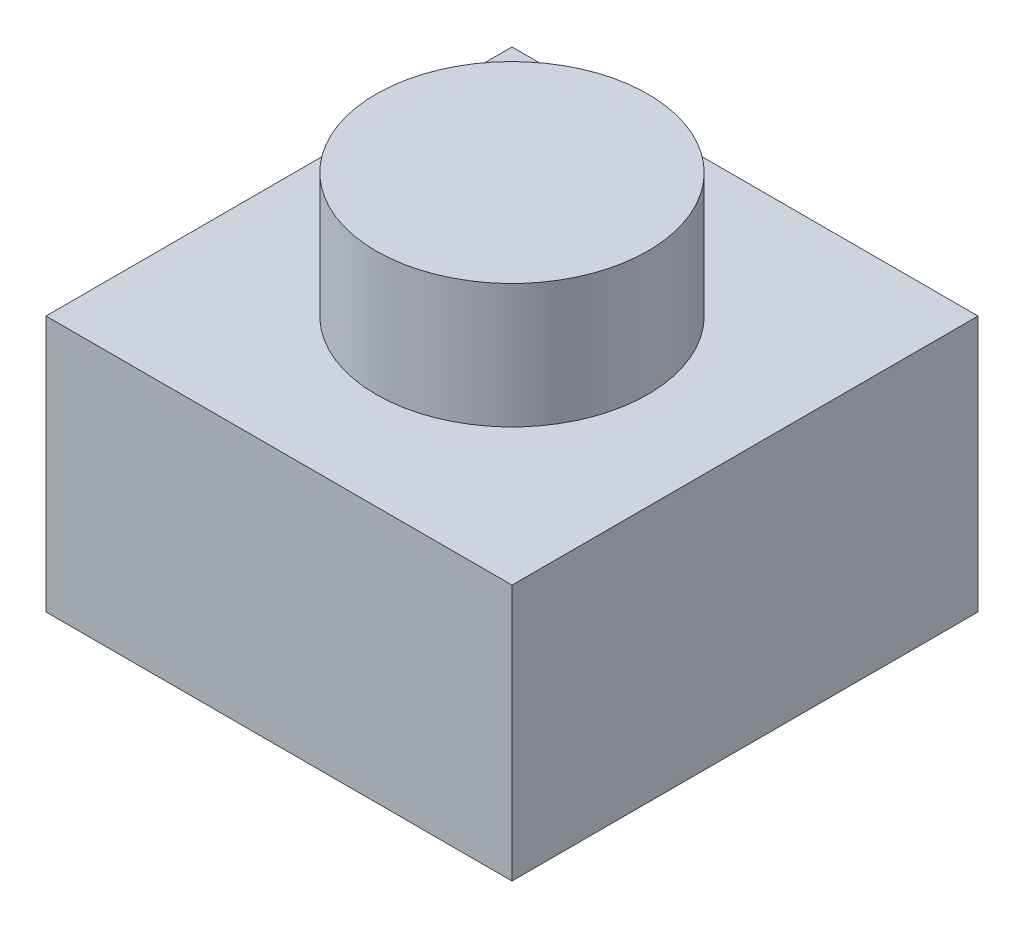
ISO-10303-21;
HEADER;
FILE_DESCRIPTION(('STEP AP214'),'2;1');
FILE_NAME('part.step','',(''),(''),'','','');
FILE_SCHEMA(('AUTOMOTIVE_DESIGN { 1 0 10303 214 1 1 1 1 }'));
ENDSEC;
DATA;
#1=APPLICATION_CONTEXT('core data for automotive mechanical design processes');
#2=APPLICATION_PROTOCOL_DEFINITION('international standard','automotive_design',2000,#1);
#3=PRODUCT_CONTEXT('',#1,'mechanical');
#4=PRODUCT('Part','Part','',(#3));
#5=PRODUCT_RELATED_PRODUCT_CATEGORY('part','',(#4));
#6=PRODUCT_DEFINITION_FORMATION('','',#4);
#7=PRODUCT_DEFINITION_CONTEXT('part definition',#1,'design');
#8=PRODUCT_DEFINITION('design','',#6,#7);
#9=PRODUCT_DEFINITION_SHAPE('','',#8);
#10=(LENGTH_UNIT() NAMED_UNIT(*) SI_UNIT(.MILLI.,.METRE.));
#11=(NAMED_UNIT(*) PLANE_ANGLE_UNIT() SI_UNIT($,.RADIAN.));
#12=(NAMED_UNIT(*) SI_UNIT($,.STERADIAN.) SOLID_ANGLE_UNIT());
#13=UNCERTAINTY_MEASURE_WITH_UNIT(LENGTH_MEASURE(1.E-05),#10,'distance_accuracy_value','');
#14=(GEOMETRIC_REPRESENTATION_CONTEXT(3) GLOBAL_UNCERTAINTY_ASSIGNED_CONTEXT((#13)) GLOBAL_UNIT_ASSIGNED_CONTEXT((#10,
#11,#12)) REPRESENTATION_CONTEXT('',''));
#15=CARTESIAN_POINT('',(0.,0.,0.));
#16=DIRECTION('',(0.,0.,1.));
#17=DIRECTION('',(1.,0.,0.));
#18=AXIS2_PLACEMENT_3D('',#15,#16,#17);
#19=CARTESIAN_POINT('',(-3.,3.3,3.));
#20=DIRECTION('',(1.,0.,0.));
#21=DIRECTION('',(0.,0.,-1.));
#22=AXIS2_PLACEMENT_3D('',#19,#20,#21);
#23=PLANE('',#22);
#24=DIRECTION('',(0.,0.,1.));
#25=VECTOR('',#24,1.);
#26=CARTESIAN_POINT('',(-3.,0.,3.));
#27=LINE('',#26,#25);
#28=CARTESIAN_POINT('',(-3.,0.,-3.));
#29=VERTEX_POINT('',#28);
#30=CARTESIAN_POINT('',(-3.,0.,3.));
#31=VERTEX_POINT('',#30);
#32=EDGE_CURVE('E98',#29,#31,#27,.T.);
#33=ORIENTED_EDGE('',*,*,#32,.T.);
#34=DIRECTION('',(0.,-1.,0.));
#35=VECTOR('',#34,1.);
#36=CARTESIAN_POINT('',(-3.,3.3,3.));
#37=LINE('',#36,#35);
#38=CARTESIAN_POINT('',(-3.,3.3,3.));
#39=VERTEX_POINT('',#38);
#40=EDGE_CURVE('E11',#39,#31,#37,.T.);
#41=ORIENTED_EDGE('',*,*,#40,.F.);
#42=DIRECTION('',(0.,0.,1.));
#43=VECTOR('',#42,1.);
#44=CARTESIAN_POINT('',(-3.,3.3,3.));
#45=LINE('',#44,#43);
#46=CARTESIAN_POINT('',(-3.,3.3,-3.));
#47=VERTEX_POINT('',#46);
#48=EDGE_CURVE('E86',#47,#39,#45,.T.);
#49=ORIENTED_EDGE('',*,*,#48,.F.);
#50=DIRECTION('',(0.,-1.,0.));
#51=VECTOR('',#50,1.);
#52=CARTESIAN_POINT('',(-3.,3.3,-3.));
#53=LINE('',#52,#51);
#54=EDGE_CURVE('E94',#47,#29,#53,.T.);
#55=ORIENTED_EDGE('',*,*,#54,.T.);
#56=EDGE_LOOP('',(#33,#41,#49,#55));
#57=FACE_BOUND('',#56,.T.);
#58=ADVANCED_FACE('F35',(#57),#23,.F.);
#59=CARTESIAN_POINT('',(3.,3.3,3.));
#60=DIRECTION('',(0.,0.,-1.));
#61=DIRECTION('',(-1.,0.,0.));
#62=AXIS2_PLACEMENT_3D('',#59,#60,#61);
#63=PLANE('',#62);
#64=DIRECTION('',(1.,0.,0.));
#65=VECTOR('',#64,1.);
#66=CARTESIAN_POINT('',(3.,0.,3.));
#67=LINE('',#66,#65);
#68=CARTESIAN_POINT('',(3.,0.,3.));
#69=VERTEX_POINT('',#68);
#70=EDGE_CURVE('E90',#31,#69,#67,.T.);
#71=ORIENTED_EDGE('',*,*,#70,.T.);
#72=DIRECTION('',(0.,-1.,0.));
#73=VECTOR('',#72,1.);
#74=CARTESIAN_POINT('',(3.,3.3,3.));
#75=LINE('',#74,#73);
#76=CARTESIAN_POINT('',(3.,3.3,3.));
#77=VERTEX_POINT('',#76);
#78=EDGE_CURVE('E43',#77,#69,#75,.T.);
#79=ORIENTED_EDGE('',*,*,#78,.F.);
#80=DIRECTION('',(1.,0.,0.));
#81=VECTOR('',#80,1.);
#82=CARTESIAN_POINT('',(3.,3.3,3.));
#83=LINE('',#82,#81);
#84=EDGE_CURVE('E81',#39,#77,#83,.T.);
#85=ORIENTED_EDGE('',*,*,#84,.F.);
#86=ORIENTED_EDGE('',*,*,#40,.T.);
#87=EDGE_LOOP('',(#71,#79,#85,#86));
#88=FACE_BOUND('',#87,.T.);
#89=ADVANCED_FACE('F89',(#88),#63,.F.);
#90=CARTESIAN_POINT('',(3.,3.3,3.));
#91=DIRECTION('',(-1.,0.,0.));
#92=DIRECTION('',(0.,0.,1.));
#93=AXIS2_PLACEMENT_3D('',#90,#91,#92);
#94=PLANE('',#93);
#95=DIRECTION('',(0.,0.,-1.));
#96=VECTOR('',#95,1.);
#97=CARTESIAN_POINT('',(3.,0.,3.));
#98=LINE('',#97,#96);
#99=CARTESIAN_POINT('',(3.,0.,-3.));
#100=VERTEX_POINT('',#99);
#101=EDGE_CURVE('E68',#69,#100,#98,.T.);
#102=ORIENTED_EDGE('',*,*,#101,.T.);
#103=DIRECTION('',(0.,-1.,0.));
#104=VECTOR('',#103,1.);
#105=CARTESIAN_POINT('',(3.,3.3,-3.));
#106=LINE('',#105,#104);
#107=CARTESIAN_POINT('',(3.,3.3,-3.));
#108=VERTEX_POINT('',#107);
#109=EDGE_CURVE('E91',#108,#100,#106,.T.);
#110=ORIENTED_EDGE('',*,*,#109,.F.);
#111=DIRECTION('',(0.,0.,-1.));
#112=VECTOR('',#111,1.);
#113=CARTESIAN_POINT('',(3.,3.3,3.));
#114=LINE('',#113,#112);
#115=EDGE_CURVE('E84',#77,#108,#114,.T.);
#116=ORIENTED_EDGE('',*,*,#115,.F.);
#117=ORIENTED_EDGE('',*,*,#78,.T.);
#118=EDGE_LOOP('',(#102,#110,#116,#117));
#119=FACE_BOUND('',#118,.T.);
#120=ADVANCED_FACE('F92',(#119),#94,.F.);
#121=CARTESIAN_POINT('',(3.,3.3,-3.));
#122=DIRECTION('',(0.,0.,1.));
#123=DIRECTION('',(1.,0.,0.));
#124=AXIS2_PLACEMENT_3D('',#121,#122,#123);
#125=PLANE('',#124);
#126=DIRECTION('',(-1.,0.,0.));
#127=VECTOR('',#126,1.);
#128=CARTESIAN_POINT('',(3.,0.,-3.));
#129=LINE('',#128,#127);
#130=EDGE_CURVE('E74',#100,#29,#129,.T.);
#131=ORIENTED_EDGE('',*,*,#130,.T.);
#132=ORIENTED_EDGE('',*,*,#54,.F.);
#133=DIRECTION('',(-1.,0.,0.));
#134=VECTOR('',#133,1.);
#135=CARTESIAN_POINT('',(3.,3.3,-3.));
#136=LINE('',#135,#134);
#137=EDGE_CURVE('E51',#108,#47,#136,.T.);
#138=ORIENTED_EDGE('',*,*,#137,.F.);
#139=ORIENTED_EDGE('',*,*,#109,.T.);
#140=EDGE_LOOP('',(#131,#132,#138,#139));
#141=FACE_BOUND('',#140,.T.);
#142=ADVANCED_FACE('F106',(#141),#125,.F.);
#143=CARTESIAN_POINT('',(0.,3.3,0.));
#144=DIRECTION('',(0.,1.,0.));
#145=DIRECTION('',(0.,0.,1.));
#146=AXIS2_PLACEMENT_3D('',#143,#144,#145);
#147=PLANE('',#146);
#148=CARTESIAN_POINT('',(0.,3.3,0.));
#149=DIRECTION('',(0.,1.,0.));
#150=DIRECTION('',(0.,0.,1.));
#151=AXIS2_PLACEMENT_3D('',#148,#149,#150);
#152=CIRCLE('',#151,1.75);
#153=CARTESIAN_POINT('',(0.,3.3,1.75));
#154=VERTEX_POINT('',#153);
#155=EDGE_CURVE('E112',#154,#154,#152,.T.);
#156=ORIENTED_EDGE('',*,*,#155,.F.);
#157=EDGE_LOOP('',(#156));
#158=FACE_BOUND('',#157,.T.);
#159=ORIENTED_EDGE('',*,*,#48,.T.);
#160=ORIENTED_EDGE('',*,*,#84,.T.);
#161=ORIENTED_EDGE('',*,*,#115,.T.);
#162=ORIENTED_EDGE('',*,*,#137,.T.);
#163=EDGE_LOOP('',(#159,#160,#161,#162));
#164=FACE_BOUND('',#163,.T.);
#165=ADVANCED_FACE('F82',(#158,#164),#147,.T.);
#166=CARTESIAN_POINT('',(0.,0.,0.));
#167=DIRECTION('',(0.,1.,0.));
#168=DIRECTION('',(0.,0.,1.));
#169=AXIS2_PLACEMENT_3D('',#166,#167,#168);
#170=PLANE('',#169);
#171=ORIENTED_EDGE('',*,*,#32,.F.);
#172=ORIENTED_EDGE('',*,*,#130,.F.);
#173=ORIENTED_EDGE('',*,*,#101,.F.);
#174=ORIENTED_EDGE('',*,*,#70,.F.);
#175=EDGE_LOOP('',(#171,#172,#173,#174));
#176=FACE_BOUND('',#175,.T.);
#177=ADVANCED_FACE('F109',(#176),#170,.F.);
#178=CARTESIAN_POINT('',(0.,4.9,0.));
#179=DIRECTION('',(0.,-1.,0.));
#180=DIRECTION('',(0.,0.,-1.));
#181=AXIS2_PLACEMENT_3D('',#178,#179,#180);
#182=CYLINDRICAL_SURFACE('',#181,1.75);
#183=CARTESIAN_POINT('',(0.,4.9,0.));
#184=DIRECTION('',(0.,1.,0.));
#185=DIRECTION('',(0.,0.,1.));
#186=AXIS2_PLACEMENT_3D('',#183,#184,#185);
#187=CIRCLE('',#186,1.75);
#188=CARTESIAN_POINT('',(0.,4.9,1.75));
#189=VERTEX_POINT('',#188);
#190=EDGE_CURVE('E101',#189,#189,#187,.T.);
#191=ORIENTED_EDGE('',*,*,#190,.F.);
#192=EDGE_LOOP('',(#191));
#193=FACE_BOUND('',#192,.T.);
#194=ORIENTED_EDGE('',*,*,#155,.T.);
#195=EDGE_LOOP('',(#194));
#196=FACE_BOUND('',#195,.T.);
#197=ADVANCED_FACE('F120',(#193,#196),#182,.T.);
#198=CARTESIAN_POINT('',(0.,4.9,0.));
#199=DIRECTION('',(0.,1.,0.));
#200=DIRECTION('',(0.,0.,1.));
#201=AXIS2_PLACEMENT_3D('',#198,#199,#200);
#202=PLANE('',#201);
#203=ORIENTED_EDGE('',*,*,#190,.T.);
#204=EDGE_LOOP('',(#203));
#205=FACE_BOUND('',#204,.T.);
#206=ADVANCED_FACE('F118',(#205),#202,.T.);
#207=CLOSED_SHELL('',(#58,#89,#120,#142,#165,#177,#197,#206));
#208=MANIFOLD_SOLID_BREP('B2',#207);
#209=ADVANCED_BREP_SHAPE_REPRESENTATION('',(#18,#208),#14);
#210=SHAPE_DEFINITION_REPRESENTATION(#9,#209);
ENDSEC;
END-ISO-10303-21;
